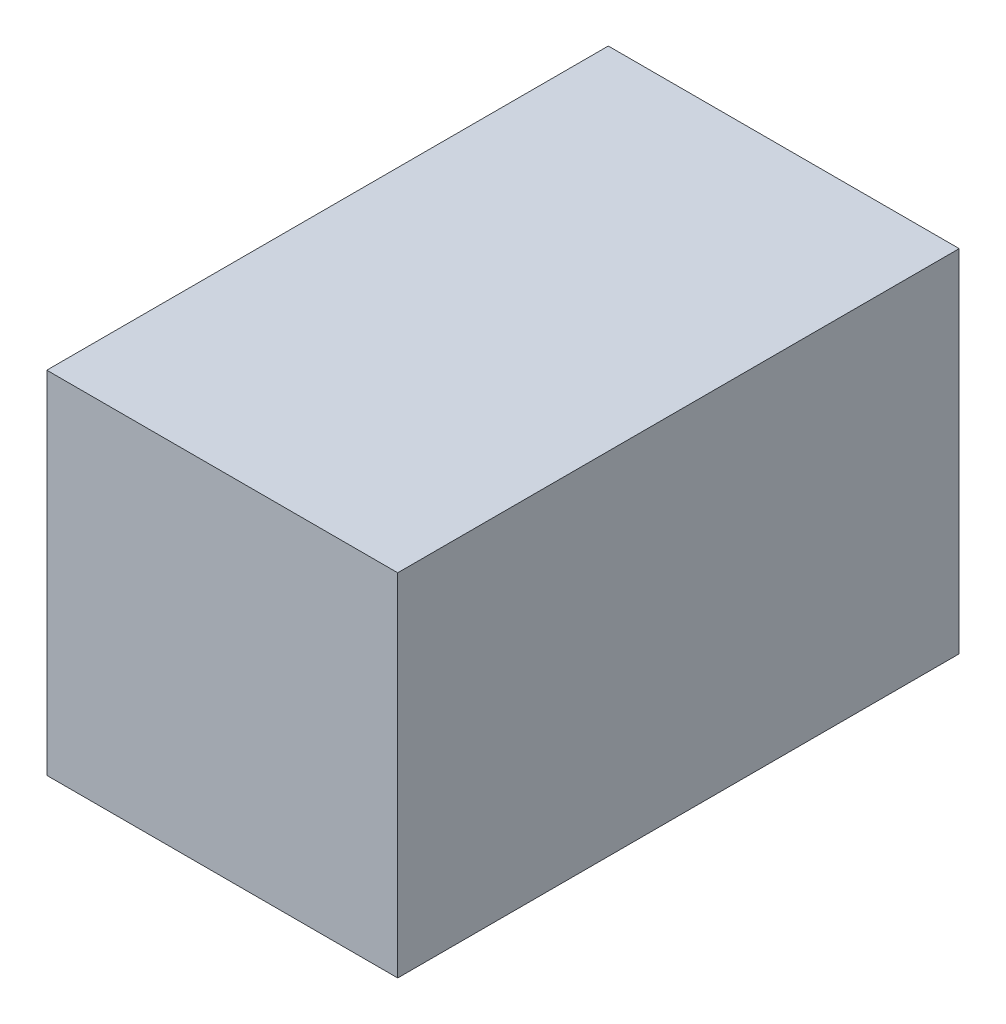
ISO-10303-21;
HEADER;
FILE_DESCRIPTION(('STEP AP214'),'2;1');
FILE_NAME('part.step','',(''),(''),'','','');
FILE_SCHEMA(('AUTOMOTIVE_DESIGN { 1 0 10303 214 1 1 1 1 }'));
ENDSEC;
DATA;
#1=APPLICATION_CONTEXT('core data for automotive mechanical design processes');
#2=APPLICATION_PROTOCOL_DEFINITION('international standard','automotive_design',2000,#1);
#3=PRODUCT_CONTEXT('',#1,'mechanical');
#4=PRODUCT('Part','Part','',(#3));
#5=PRODUCT_RELATED_PRODUCT_CATEGORY('part','',(#4));
#6=PRODUCT_DEFINITION_FORMATION('','',#4);
#7=PRODUCT_DEFINITION_CONTEXT('part definition',#1,'design');
#8=PRODUCT_DEFINITION('design','',#6,#7);
#9=PRODUCT_DEFINITION_SHAPE('','',#8);
#10=(LENGTH_UNIT() NAMED_UNIT(*) SI_UNIT(.MILLI.,.METRE.));
#11=(NAMED_UNIT(*) PLANE_ANGLE_UNIT() SI_UNIT($,.RADIAN.));
#12=(NAMED_UNIT(*) SI_UNIT($,.STERADIAN.) SOLID_ANGLE_UNIT());
#13=UNCERTAINTY_MEASURE_WITH_UNIT(LENGTH_MEASURE(1.E-05),#10,'distance_accuracy_value','');
#14=(GEOMETRIC_REPRESENTATION_CONTEXT(3) GLOBAL_UNCERTAINTY_ASSIGNED_CONTEXT((#13)) GLOBAL_UNIT_ASSIGNED_CONTEXT((#10,
#11,#12)) REPRESENTATION_CONTEXT('',''));
#15=CARTESIAN_POINT('',(0.,0.,0.));
#16=DIRECTION('',(0.,0.,1.));
#17=DIRECTION('',(1.,0.,0.));
#18=AXIS2_PLACEMENT_3D('',#15,#16,#17);
#19=CARTESIAN_POINT('',(0.5,1.,-0.8));
#20=DIRECTION('',(-1.,0.,0.));
#21=DIRECTION('',(0.,0.,1.));
#22=AXIS2_PLACEMENT_3D('',#19,#20,#21);
#23=PLANE('',#22);
#24=DIRECTION('',(0.,0.,-1.));
#25=VECTOR('',#24,1.);
#26=CARTESIAN_POINT('',(0.5,0.,-0.8));
#27=LINE('',#26,#25);
#28=CARTESIAN_POINT('',(0.5,0.,0.8));
#29=VERTEX_POINT('',#28);
#30=CARTESIAN_POINT('',(0.5,0.,-0.8));
#31=VERTEX_POINT('',#30);
#32=EDGE_CURVE('E99',#29,#31,#27,.T.);
#33=ORIENTED_EDGE('',*,*,#32,.T.);
#34=DIRECTION('',(0.,-1.,0.));
#35=VECTOR('',#34,1.);
#36=CARTESIAN_POINT('',(0.5,1.,-0.8));
#37=LINE('',#36,#35);
#38=CARTESIAN_POINT('',(0.5,1.,-0.8));
#39=VERTEX_POINT('',#38);
#40=EDGE_CURVE('E11',#39,#31,#37,.T.);
#41=ORIENTED_EDGE('',*,*,#40,.F.);
#42=DIRECTION('',(0.,0.,-1.));
#43=VECTOR('',#42,1.);
#44=CARTESIAN_POINT('',(0.5,1.,-0.8));
#45=LINE('',#44,#43);
#46=CARTESIAN_POINT('',(0.5,1.,0.8));
#47=VERTEX_POINT('',#46);
#48=EDGE_CURVE('E87',#47,#39,#45,.T.);
#49=ORIENTED_EDGE('',*,*,#48,.F.);
#50=DIRECTION('',(0.,-1.,0.));
#51=VECTOR('',#50,1.);
#52=CARTESIAN_POINT('',(0.5,1.,0.8));
#53=LINE('',#52,#51);
#54=EDGE_CURVE('E95',#47,#29,#53,.T.);
#55=ORIENTED_EDGE('',*,*,#54,.T.);
#56=EDGE_LOOP('',(#33,#41,#49,#55));
#57=FACE_BOUND('',#56,.T.);
#58=ADVANCED_FACE('F36',(#57),#23,.F.);
#59=CARTESIAN_POINT('',(-0.5,1.,-0.8));
#60=DIRECTION('',(0.,0.,1.));
#61=DIRECTION('',(1.,0.,0.));
#62=AXIS2_PLACEMENT_3D('',#59,#60,#61);
#63=PLANE('',#62);
#64=DIRECTION('',(-1.,0.,0.));
#65=VECTOR('',#64,1.);
#66=CARTESIAN_POINT('',(-0.5,0.,-0.8));
#67=LINE('',#66,#65);
#68=CARTESIAN_POINT('',(-0.5,0.,-0.8));
#69=VERTEX_POINT('',#68);
#70=EDGE_CURVE('E91',#31,#69,#67,.T.);
#71=ORIENTED_EDGE('',*,*,#70,.T.);
#72=DIRECTION('',(0.,-1.,0.));
#73=VECTOR('',#72,1.);
#74=CARTESIAN_POINT('',(-0.5,1.,-0.8));
#75=LINE('',#74,#73);
#76=CARTESIAN_POINT('',(-0.5,1.,-0.8));
#77=VERTEX_POINT('',#76);
#78=EDGE_CURVE('E44',#77,#69,#75,.T.);
#79=ORIENTED_EDGE('',*,*,#78,.F.);
#80=DIRECTION('',(-1.,0.,0.));
#81=VECTOR('',#80,1.);
#82=CARTESIAN_POINT('',(-0.5,1.,-0.8));
#83=LINE('',#82,#81);
#84=EDGE_CURVE('E82',#39,#77,#83,.T.);
#85=ORIENTED_EDGE('',*,*,#84,.F.);
#86=ORIENTED_EDGE('',*,*,#40,.T.);
#87=EDGE_LOOP('',(#71,#79,#85,#86));
#88=FACE_BOUND('',#87,.T.);
#89=ADVANCED_FACE('F90',(#88),#63,.F.);
#90=CARTESIAN_POINT('',(-0.5,1.,-0.8));
#91=DIRECTION('',(1.,0.,0.));
#92=DIRECTION('',(0.,0.,-1.));
#93=AXIS2_PLACEMENT_3D('',#90,#91,#92);
#94=PLANE('',#93);
#95=DIRECTION('',(0.,0.,1.));
#96=VECTOR('',#95,1.);
#97=CARTESIAN_POINT('',(-0.5,0.,-0.8));
#98=LINE('',#97,#96);
#99=CARTESIAN_POINT('',(-0.5,0.,0.8));
#100=VERTEX_POINT('',#99);
#101=EDGE_CURVE('E69',#69,#100,#98,.T.);
#102=ORIENTED_EDGE('',*,*,#101,.T.);
#103=DIRECTION('',(0.,-1.,0.));
#104=VECTOR('',#103,1.);
#105=CARTESIAN_POINT('',(-0.5,1.,0.8));
#106=LINE('',#105,#104);
#107=CARTESIAN_POINT('',(-0.5,1.,0.8));
#108=VERTEX_POINT('',#107);
#109=EDGE_CURVE('E92',#108,#100,#106,.T.);
#110=ORIENTED_EDGE('',*,*,#109,.F.);
#111=DIRECTION('',(0.,0.,1.));
#112=VECTOR('',#111,1.);
#113=CARTESIAN_POINT('',(-0.5,1.,-0.8));
#114=LINE('',#113,#112);
#115=EDGE_CURVE('E85',#77,#108,#114,.T.);
#116=ORIENTED_EDGE('',*,*,#115,.F.);
#117=ORIENTED_EDGE('',*,*,#78,.T.);
#118=EDGE_LOOP('',(#102,#110,#116,#117));
#119=FACE_BOUND('',#118,.T.);
#120=ADVANCED_FACE('F93',(#119),#94,.F.);
#121=CARTESIAN_POINT('',(-0.5,1.,0.8));
#122=DIRECTION('',(0.,0.,-1.));
#123=DIRECTION('',(-1.,0.,0.));
#124=AXIS2_PLACEMENT_3D('',#121,#122,#123);
#125=PLANE('',#124);
#126=DIRECTION('',(1.,0.,0.));
#127=VECTOR('',#126,1.);
#128=CARTESIAN_POINT('',(-0.5,0.,0.8));
#129=LINE('',#128,#127);
#130=EDGE_CURVE('E75',#100,#29,#129,.T.);
#131=ORIENTED_EDGE('',*,*,#130,.T.);
#132=ORIENTED_EDGE('',*,*,#54,.F.);
#133=DIRECTION('',(1.,0.,0.));
#134=VECTOR('',#133,1.);
#135=CARTESIAN_POINT('',(-0.5,1.,0.8));
#136=LINE('',#135,#134);
#137=EDGE_CURVE('E52',#108,#47,#136,.T.);
#138=ORIENTED_EDGE('',*,*,#137,.F.);
#139=ORIENTED_EDGE('',*,*,#109,.T.);
#140=EDGE_LOOP('',(#131,#132,#138,#139));
#141=FACE_BOUND('',#140,.T.);
#142=ADVANCED_FACE('F106',(#141),#125,.F.);
#143=CARTESIAN_POINT('',(0.,1.,0.));
#144=DIRECTION('',(0.,1.,0.));
#145=DIRECTION('',(0.,0.,1.));
#146=AXIS2_PLACEMENT_3D('',#143,#144,#145);
#147=PLANE('',#146);
#148=ORIENTED_EDGE('',*,*,#48,.T.);
#149=ORIENTED_EDGE('',*,*,#84,.T.);
#150=ORIENTED_EDGE('',*,*,#115,.T.);
#151=ORIENTED_EDGE('',*,*,#137,.T.);
#152=EDGE_LOOP('',(#148,#149,#150,#151));
#153=FACE_BOUND('',#152,.T.);
#154=ADVANCED_FACE('F83',(#153),#147,.T.);
#155=CARTESIAN_POINT('',(0.,0.,0.));
#156=DIRECTION('',(0.,1.,0.));
#157=DIRECTION('',(0.,0.,1.));
#158=AXIS2_PLACEMENT_3D('',#155,#156,#157);
#159=PLANE('',#158);
#160=ORIENTED_EDGE('',*,*,#32,.F.);
#161=ORIENTED_EDGE('',*,*,#130,.F.);
#162=ORIENTED_EDGE('',*,*,#101,.F.);
#163=ORIENTED_EDGE('',*,*,#70,.F.);
#164=EDGE_LOOP('',(#160,#161,#162,#163));
#165=FACE_BOUND('',#164,.T.);
#166=ADVANCED_FACE('F109',(#165),#159,.F.);
#167=CLOSED_SHELL('',(#58,#89,#120,#142,#154,#166));
#168=MANIFOLD_SOLID_BREP('B2',#167);
#169=ADVANCED_BREP_SHAPE_REPRESENTATION('',(#18,#168),#14);
#170=SHAPE_DEFINITION_REPRESENTATION(#9,#169);
ENDSEC;
END-ISO-10303-21;
